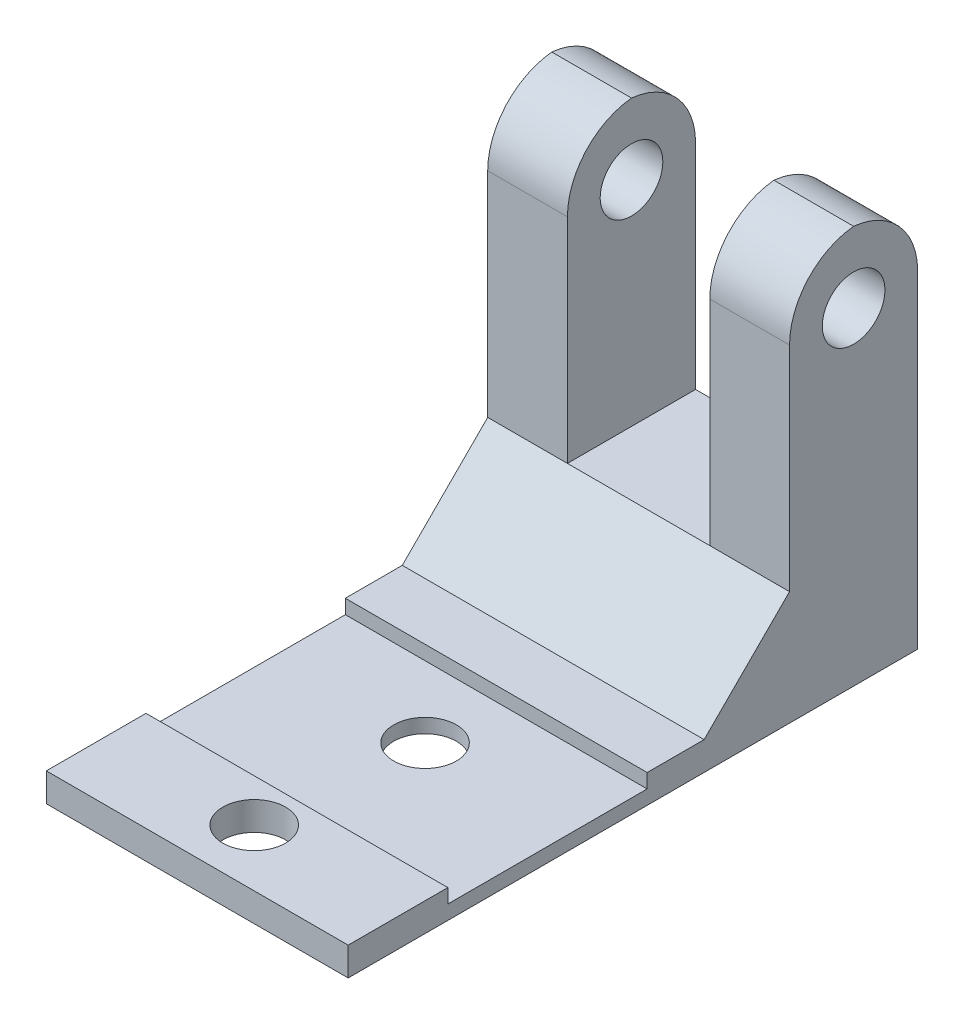
ISO-10303-21;
HEADER;
FILE_DESCRIPTION(('STEP AP214'),'2;1');
FILE_NAME('part.step','',(''),(''),'','','');
FILE_SCHEMA(('AUTOMOTIVE_DESIGN { 1 0 10303 214 1 1 1 1 }'));
ENDSEC;
DATA;
#1=APPLICATION_CONTEXT('core data for automotive mechanical design processes');
#2=APPLICATION_PROTOCOL_DEFINITION('international standard','automotive_design',2000,#1);
#3=PRODUCT_CONTEXT('',#1,'mechanical');
#4=PRODUCT('Part','Part','',(#3));
#5=PRODUCT_RELATED_PRODUCT_CATEGORY('part','',(#4));
#6=PRODUCT_DEFINITION_FORMATION('','',#4);
#7=PRODUCT_DEFINITION_CONTEXT('part definition',#1,'design');
#8=PRODUCT_DEFINITION('design','',#6,#7);
#9=PRODUCT_DEFINITION_SHAPE('','',#8);
#10=(LENGTH_UNIT() NAMED_UNIT(*) SI_UNIT(.MILLI.,.METRE.));
#11=(NAMED_UNIT(*) PLANE_ANGLE_UNIT() SI_UNIT($,.RADIAN.));
#12=(NAMED_UNIT(*) SI_UNIT($,.STERADIAN.) SOLID_ANGLE_UNIT());
#13=UNCERTAINTY_MEASURE_WITH_UNIT(LENGTH_MEASURE(1.E-05),#10,'distance_accuracy_value','');
#14=(GEOMETRIC_REPRESENTATION_CONTEXT(3) GLOBAL_UNCERTAINTY_ASSIGNED_CONTEXT((#13)) GLOBAL_UNIT_ASSIGNED_CONTEXT((#10,
#11,#12)) REPRESENTATION_CONTEXT('',''));
#15=CARTESIAN_POINT('',(0.,0.,0.));
#16=DIRECTION('',(0.,0.,1.));
#17=DIRECTION('',(1.,0.,0.));
#18=AXIS2_PLACEMENT_3D('',#15,#16,#17);
#19=CARTESIAN_POINT('',(0.,1.,0.));
#20=DIRECTION('',(0.,1.,0.));
#21=DIRECTION('',(0.,0.,1.));
#22=AXIS2_PLACEMENT_3D('',#19,#20,#21);
#23=PLANE('',#22);
#24=DIRECTION('',(-1.,0.,0.));
#25=VECTOR('',#24,1.);
#26=CARTESIAN_POINT('',(-14.28,1.,-7.29000000000001));
#27=LINE('',#26,#25);
#28=CARTESIAN_POINT('',(-3.67999999999999,1.,-7.29000000000001));
#29=VERTEX_POINT('',#28);
#30=CARTESIAN_POINT('',(-14.28,1.,-7.29000000000001));
#31=VERTEX_POINT('',#30);
#32=EDGE_CURVE('E171',#29,#31,#27,.T.);
#33=ORIENTED_EDGE('',*,*,#32,.F.);
#34=DIRECTION('',(0.,0.,-1.));
#35=VECTOR('',#34,1.);
#36=CARTESIAN_POINT('',(-3.67999999999999,1.,6.21000000000001));
#37=LINE('',#36,#35);
#38=CARTESIAN_POINT('',(-3.67999999999999,1.,-9.29000000000001));
#39=VERTEX_POINT('',#38);
#40=EDGE_CURVE('E313',#29,#39,#37,.T.);
#41=ORIENTED_EDGE('',*,*,#40,.T.);
#42=DIRECTION('',(-1.,0.,0.));
#43=VECTOR('',#42,1.);
#44=CARTESIAN_POINT('',(0.,1.,-9.29000000000001));
#45=LINE('',#44,#43);
#46=CARTESIAN_POINT('',(-14.28,1.,-9.29000000000001));
#47=VERTEX_POINT('',#46);
#48=EDGE_CURVE('E310',#39,#47,#45,.T.);
#49=ORIENTED_EDGE('',*,*,#48,.T.);
#50=DIRECTION('',(0.,0.,1.));
#51=VECTOR('',#50,1.);
#52=CARTESIAN_POINT('',(-14.28,1.,-13.79));
#53=LINE('',#52,#51);
#54=EDGE_CURVE('E242',#47,#31,#53,.T.);
#55=ORIENTED_EDGE('',*,*,#54,.T.);
#56=EDGE_LOOP('',(#33,#41,#49,#55));
#57=FACE_BOUND('',#56,.T.);
#58=ADVANCED_FACE('F33',(#57),#23,.T.);
#59=CARTESIAN_POINT('',(-6.47999999999999,1.,-13.79));
#60=DIRECTION('',(1.,0.,0.));
#61=DIRECTION('',(0.,0.,-1.));
#62=AXIS2_PLACEMENT_3D('',#59,#60,#61);
#63=PLANE('',#62);
#64=CARTESIAN_POINT('',(-6.47999999999999,11.5,-14.54));
#65=DIRECTION('',(1.,0.,0.));
#66=DIRECTION('',(0.,0.,-1.));
#67=AXIS2_PLACEMENT_3D('',#64,#65,#66);
#68=CIRCLE('',#67,1.1);
#69=CARTESIAN_POINT('',(-6.47999999999999,11.5,-15.64));
#70=VERTEX_POINT('',#69);
#71=EDGE_CURVE('E435',#70,#70,#68,.T.);
#72=ORIENTED_EDGE('',*,*,#71,.T.);
#73=EDGE_LOOP('',(#72));
#74=FACE_BOUND('',#73,.T.);
#75=DIRECTION('',(0.,1.,0.));
#76=VECTOR('',#75,1.);
#77=CARTESIAN_POINT('',(-6.47999999999999,1.,-12.29));
#78=LINE('',#77,#76);
#79=CARTESIAN_POINT('',(-6.47999999999999,4.00000000000002,-12.29));
#80=VERTEX_POINT('',#79);
#81=CARTESIAN_POINT('',(-6.47999999999999,11.5,-12.29));
#82=VERTEX_POINT('',#81);
#83=EDGE_CURVE('E209',#80,#82,#78,.T.);
#84=ORIENTED_EDGE('',*,*,#83,.T.);
#85=CARTESIAN_POINT('',(-6.47999999999999,11.5,-14.79));
#86=DIRECTION('',(1.,0.,0.));
#87=DIRECTION('',(0.,0.,-1.));
#88=AXIS2_PLACEMENT_3D('',#85,#86,#87);
#89=CIRCLE('',#88,2.5);
#90=CARTESIAN_POINT('',(-6.47999999999999,13.9874685927666,-14.54));
#91=VERTEX_POINT('',#90);
#92=EDGE_CURVE('E11',#82,#91,#89,.F.);
#93=ORIENTED_EDGE('',*,*,#92,.T.);
#94=CARTESIAN_POINT('',(-6.47999999999999,11.5,-14.29));
#95=DIRECTION('',(1.,0.,0.));
#96=DIRECTION('',(0.,0.,-1.));
#97=AXIS2_PLACEMENT_3D('',#94,#95,#96);
#98=CIRCLE('',#97,2.5);
#99=CARTESIAN_POINT('',(-6.47999999999999,11.5,-16.79));
#100=VERTEX_POINT('',#99);
#101=EDGE_CURVE('E42',#91,#100,#98,.F.);
#102=ORIENTED_EDGE('',*,*,#101,.T.);
#103=DIRECTION('',(0.,1.,0.));
#104=VECTOR('',#103,1.);
#105=CARTESIAN_POINT('',(-6.47999999999999,9.,-16.79));
#106=LINE('',#105,#104);
#107=CARTESIAN_POINT('',(-6.47999999999999,4.00000000000002,-16.79));
#108=VERTEX_POINT('',#107);
#109=EDGE_CURVE('E223',#108,#100,#106,.T.);
#110=ORIENTED_EDGE('',*,*,#109,.F.);
#111=DIRECTION('',(0.,0.,-1.));
#112=VECTOR('',#111,1.);
#113=CARTESIAN_POINT('',(-6.47999999999999,4.00000000000002,-13.79));
#114=LINE('',#113,#112);
#115=EDGE_CURVE('E193',#80,#108,#114,.T.);
#116=ORIENTED_EDGE('',*,*,#115,.F.);
#117=EDGE_LOOP('',(#84,#93,#102,#110,#116));
#118=FACE_BOUND('',#117,.T.);
#119=ADVANCED_FACE('F287',(#74,#118),#63,.F.);
#120=CARTESIAN_POINT('',(-11.48,1.,-8.79));
#121=DIRECTION('',(-1.,0.,0.));
#122=DIRECTION('',(0.,0.,1.));
#123=AXIS2_PLACEMENT_3D('',#120,#121,#122);
#124=PLANE('',#123);
#125=CARTESIAN_POINT('',(-11.48,11.5,-14.54));
#126=DIRECTION('',(-1.,0.,0.));
#127=DIRECTION('',(0.,0.,1.));
#128=AXIS2_PLACEMENT_3D('',#125,#126,#127);
#129=CIRCLE('',#128,1.1);
#130=CARTESIAN_POINT('',(-11.48,11.5,-13.44));
#131=VERTEX_POINT('',#130);
#132=EDGE_CURVE('E436',#131,#131,#129,.T.);
#133=ORIENTED_EDGE('',*,*,#132,.T.);
#134=EDGE_LOOP('',(#133));
#135=FACE_BOUND('',#134,.T.);
#136=DIRECTION('',(0.,-1.,0.));
#137=VECTOR('',#136,1.);
#138=CARTESIAN_POINT('',(-11.48,9.,-16.79));
#139=LINE('',#138,#137);
#140=CARTESIAN_POINT('',(-11.48,11.5,-16.79));
#141=VERTEX_POINT('',#140);
#142=CARTESIAN_POINT('',(-11.48,4.00000000000002,-16.79));
#143=VERTEX_POINT('',#142);
#144=EDGE_CURVE('E214',#141,#143,#139,.T.);
#145=ORIENTED_EDGE('',*,*,#144,.F.);
#146=CARTESIAN_POINT('',(-11.48,11.5,-14.29));
#147=DIRECTION('',(-1.,0.,0.));
#148=DIRECTION('',(0.,0.,1.));
#149=AXIS2_PLACEMENT_3D('',#146,#147,#148);
#150=CIRCLE('',#149,2.5);
#151=CARTESIAN_POINT('',(-11.48,13.9874685927666,-14.54));
#152=VERTEX_POINT('',#151);
#153=EDGE_CURVE('E262',#141,#152,#150,.F.);
#154=ORIENTED_EDGE('',*,*,#153,.T.);
#155=CARTESIAN_POINT('',(-11.48,11.5,-14.79));
#156=DIRECTION('',(-1.,0.,0.));
#157=DIRECTION('',(0.,0.,1.));
#158=AXIS2_PLACEMENT_3D('',#155,#156,#157);
#159=CIRCLE('',#158,2.5);
#160=CARTESIAN_POINT('',(-11.48,11.5,-12.29));
#161=VERTEX_POINT('',#160);
#162=EDGE_CURVE('E260',#152,#161,#159,.F.);
#163=ORIENTED_EDGE('',*,*,#162,.T.);
#164=DIRECTION('',(0.,-1.,0.));
#165=VECTOR('',#164,1.);
#166=CARTESIAN_POINT('',(-11.48,1.,-12.29));
#167=LINE('',#166,#165);
#168=CARTESIAN_POINT('',(-11.48,4.00000000000002,-12.29));
#169=VERTEX_POINT('',#168);
#170=EDGE_CURVE('E207',#161,#169,#167,.T.);
#171=ORIENTED_EDGE('',*,*,#170,.T.);
#172=DIRECTION('',(0.,0.,1.));
#173=VECTOR('',#172,1.);
#174=CARTESIAN_POINT('',(-11.48,4.00000000000002,-12.29));
#175=LINE('',#174,#173);
#176=EDGE_CURVE('E183',#143,#169,#175,.T.);
#177=ORIENTED_EDGE('',*,*,#176,.F.);
#178=EDGE_LOOP('',(#145,#154,#163,#171,#177));
#179=FACE_BOUND('',#178,.T.);
#180=ADVANCED_FACE('F354',(#135,#179),#124,.F.);
#181=DIRECTION('',(1.,0.,0.));
#182=VECTOR('',#181,1.);
#183=CARTESIAN_POINT('',(-14.28,1.,-0.289999999999993));
#184=LINE('',#183,#182);
#185=CARTESIAN_POINT('',(-14.28,1.,-0.289999999999993));
#186=VERTEX_POINT('',#185);
#187=CARTESIAN_POINT('',(-3.67999999999999,1.,-0.289999999999993));
#188=VERTEX_POINT('',#187);
#189=EDGE_CURVE('E389',#186,#188,#184,.T.);
#190=ORIENTED_EDGE('',*,*,#189,.F.);
#191=CARTESIAN_POINT('',(-14.28,1.,3.21000000000001));
#192=VERTEX_POINT('',#191);
#193=EDGE_CURVE('E176',#186,#192,#53,.T.);
#194=ORIENTED_EDGE('',*,*,#193,.T.);
#195=DIRECTION('',(-1.,0.,0.));
#196=VECTOR('',#195,1.);
#197=CARTESIAN_POINT('',(-3.67999999999999,1.,3.21000000000001));
#198=LINE('',#197,#196);
#199=CARTESIAN_POINT('',(-3.67999999999999,1.,3.21000000000001));
#200=VERTEX_POINT('',#199);
#201=EDGE_CURVE('E196',#200,#192,#198,.T.);
#202=ORIENTED_EDGE('',*,*,#201,.F.);
#203=EDGE_CURVE('E238',#200,#188,#37,.T.);
#204=ORIENTED_EDGE('',*,*,#203,.T.);
#205=EDGE_LOOP('',(#190,#194,#202,#204));
#206=FACE_BOUND('',#205,.T.);
#207=CARTESIAN_POINT('',(-8.98,1.,1.21000000000001));
#208=DIRECTION('',(0.,1.,0.));
#209=DIRECTION('',(0.,0.,1.));
#210=AXIS2_PLACEMENT_3D('',#207,#208,#209);
#211=CIRCLE('',#210,1.1);
#212=CARTESIAN_POINT('',(-8.98,1.,2.31000000000001));
#213=VERTEX_POINT('',#212);
#214=EDGE_CURVE('E227',#213,#213,#211,.T.);
#215=ORIENTED_EDGE('',*,*,#214,.F.);
#216=EDGE_LOOP('',(#215));
#217=FACE_BOUND('',#216,.T.);
#218=ADVANCED_FACE('F370',(#206,#217),#23,.T.);
#219=CARTESIAN_POINT('',(0.,0.,0.));
#220=DIRECTION('',(0.,1.,0.));
#221=DIRECTION('',(0.,0.,1.));
#222=AXIS2_PLACEMENT_3D('',#219,#220,#221);
#223=PLANE('',#222);
#224=DIRECTION('',(-1.,0.,0.));
#225=VECTOR('',#224,1.);
#226=CARTESIAN_POINT('',(-3.67999999999999,0.,-16.79));
#227=LINE('',#226,#225);
#228=CARTESIAN_POINT('',(-3.67999999999999,0.,-16.79));
#229=VERTEX_POINT('',#228);
#230=CARTESIAN_POINT('',(-14.28,0.,-16.79));
#231=VERTEX_POINT('',#230);
#232=EDGE_CURVE('E221',#229,#231,#227,.T.);
#233=ORIENTED_EDGE('',*,*,#232,.F.);
#234=DIRECTION('',(0.,0.,-1.));
#235=VECTOR('',#234,1.);
#236=CARTESIAN_POINT('',(-3.67999999999999,0.,6.21000000000001));
#237=LINE('',#236,#235);
#238=CARTESIAN_POINT('',(-3.67999999999999,0.,3.21000000000001));
#239=VERTEX_POINT('',#238);
#240=EDGE_CURVE('E248',#239,#229,#237,.T.);
#241=ORIENTED_EDGE('',*,*,#240,.F.);
#242=DIRECTION('',(-1.,0.,0.));
#243=VECTOR('',#242,1.);
#244=CARTESIAN_POINT('',(0.,0.,3.21000000000001));
#245=LINE('',#244,#243);
#246=CARTESIAN_POINT('',(-14.28,0.,3.21000000000001));
#247=VERTEX_POINT('',#246);
#248=EDGE_CURVE('E201',#239,#247,#245,.T.);
#249=ORIENTED_EDGE('',*,*,#248,.T.);
#250=DIRECTION('',(0.,0.,1.));
#251=VECTOR('',#250,1.);
#252=CARTESIAN_POINT('',(-14.28,0.,-13.79));
#253=LINE('',#252,#251);
#254=EDGE_CURVE('E235',#231,#247,#253,.T.);
#255=ORIENTED_EDGE('',*,*,#254,.F.);
#256=EDGE_LOOP('',(#233,#241,#249,#255));
#257=FACE_BOUND('',#256,.T.);
#258=CARTESIAN_POINT('',(-8.98,0.,1.21000000000001));
#259=DIRECTION('',(0.,1.,0.));
#260=DIRECTION('',(0.,0.,1.));
#261=AXIS2_PLACEMENT_3D('',#258,#259,#260);
#262=CIRCLE('',#261,1.1);
#263=CARTESIAN_POINT('',(-8.98,0.,2.31000000000001));
#264=VERTEX_POINT('',#263);
#265=EDGE_CURVE('E226',#264,#264,#262,.T.);
#266=ORIENTED_EDGE('',*,*,#265,.T.);
#267=EDGE_LOOP('',(#266));
#268=FACE_BOUND('',#267,.T.);
#269=CARTESIAN_POINT('',(-8.97999999999999,0.,-4.78999999999999));
#270=DIRECTION('',(0.,1.,0.));
#271=DIRECTION('',(0.,0.,1.));
#272=AXIS2_PLACEMENT_3D('',#269,#270,#271);
#273=CIRCLE('',#272,1.1);
#274=CARTESIAN_POINT('',(-8.97999999999999,0.,-3.68999999999999));
#275=VERTEX_POINT('',#274);
#276=EDGE_CURVE('E230',#275,#275,#273,.T.);
#277=ORIENTED_EDGE('',*,*,#276,.T.);
#278=EDGE_LOOP('',(#277));
#279=FACE_BOUND('',#278,.T.);
#280=ADVANCED_FACE('F321',(#257,#268,#279),#223,.F.);
#281=CARTESIAN_POINT('',(-14.28,1.,-13.79));
#282=DIRECTION('',(1.,0.,0.));
#283=DIRECTION('',(0.,0.,-1.));
#284=AXIS2_PLACEMENT_3D('',#281,#282,#283);
#285=PLANE('',#284);
#286=CARTESIAN_POINT('',(-14.28,11.5,-14.54));
#287=DIRECTION('',(1.,0.,0.));
#288=DIRECTION('',(0.,0.,-1.));
#289=AXIS2_PLACEMENT_3D('',#286,#287,#288);
#290=CIRCLE('',#289,1.1);
#291=CARTESIAN_POINT('',(-14.28,11.5,-15.64));
#292=VERTEX_POINT('',#291);
#293=EDGE_CURVE('E279',#292,#292,#290,.T.);
#294=ORIENTED_EDGE('',*,*,#293,.T.);
#295=EDGE_LOOP('',(#294));
#296=FACE_BOUND('',#295,.T.);
#297=CARTESIAN_POINT('',(-14.28,11.5,-14.79));
#298=DIRECTION('',(1.,0.,0.));
#299=DIRECTION('',(0.,0.,-1.));
#300=AXIS2_PLACEMENT_3D('',#297,#298,#299);
#301=CIRCLE('',#300,2.5);
#302=CARTESIAN_POINT('',(-14.28,11.5,-12.29));
#303=VERTEX_POINT('',#302);
#304=CARTESIAN_POINT('',(-14.28,13.9874685927666,-14.54));
#305=VERTEX_POINT('',#304);
#306=EDGE_CURVE('E250',#303,#305,#301,.F.);
#307=ORIENTED_EDGE('',*,*,#306,.T.);
#308=CARTESIAN_POINT('',(-14.28,11.5,-14.29));
#309=DIRECTION('',(1.,0.,0.));
#310=DIRECTION('',(0.,0.,-1.));
#311=AXIS2_PLACEMENT_3D('',#308,#309,#310);
#312=CIRCLE('',#311,2.5);
#313=CARTESIAN_POINT('',(-14.28,11.5,-16.79));
#314=VERTEX_POINT('',#313);
#315=EDGE_CURVE('E252',#305,#314,#312,.F.);
#316=ORIENTED_EDGE('',*,*,#315,.T.);
#317=DIRECTION('',(0.,1.,0.));
#318=VECTOR('',#317,1.);
#319=CARTESIAN_POINT('',(-14.28,9.,-16.79));
#320=LINE('',#319,#318);
#321=EDGE_CURVE('E216',#231,#314,#320,.T.);
#322=ORIENTED_EDGE('',*,*,#321,.F.);
#323=ORIENTED_EDGE('',*,*,#254,.T.);
#324=DIRECTION('',(0.,1.,0.));
#325=VECTOR('',#324,1.);
#326=CARTESIAN_POINT('',(-14.28,-9.,3.21000000000001));
#327=LINE('',#326,#325);
#328=EDGE_CURVE('E199',#247,#192,#327,.T.);
#329=ORIENTED_EDGE('',*,*,#328,.T.);
#330=ORIENTED_EDGE('',*,*,#193,.F.);
#331=DIRECTION('',(0.,1.,0.));
#332=VECTOR('',#331,1.);
#333=CARTESIAN_POINT('',(-14.28,0.5,-0.289999999999993));
#334=LINE('',#333,#332);
#335=CARTESIAN_POINT('',(-14.28,0.5,-0.289999999999993));
#336=VERTEX_POINT('',#335);
#337=EDGE_CURVE('E155',#336,#186,#334,.T.);
#338=ORIENTED_EDGE('',*,*,#337,.F.);
#339=DIRECTION('',(0.,0.,1.));
#340=VECTOR('',#339,1.);
#341=CARTESIAN_POINT('',(-14.28,0.5,-0.289999999999993));
#342=LINE('',#341,#340);
#343=CARTESIAN_POINT('',(-14.28,0.5,-7.29000000000001));
#344=VERTEX_POINT('',#343);
#345=EDGE_CURVE('E162',#344,#336,#342,.T.);
#346=ORIENTED_EDGE('',*,*,#345,.F.);
#347=DIRECTION('',(0.,1.,0.));
#348=VECTOR('',#347,1.);
#349=CARTESIAN_POINT('',(-14.28,0.5,-7.29000000000001));
#350=LINE('',#349,#348);
#351=EDGE_CURVE('E345',#344,#31,#350,.T.);
#352=ORIENTED_EDGE('',*,*,#351,.T.);
#353=ORIENTED_EDGE('',*,*,#54,.F.);
#354=DIRECTION('',(0.,0.707106781186552,-0.707106781186543));
#355=VECTOR('',#354,1.);
#356=CARTESIAN_POINT('',(-14.28,3.24999999999999,-11.54));
#357=LINE('',#356,#355);
#358=CARTESIAN_POINT('',(-14.28,4.00000000000002,-12.29));
#359=VERTEX_POINT('',#358);
#360=EDGE_CURVE('E331',#47,#359,#357,.T.);
#361=ORIENTED_EDGE('',*,*,#360,.T.);
#362=DIRECTION('',(0.,1.,0.));
#363=VECTOR('',#362,1.);
#364=CARTESIAN_POINT('',(-14.28,1.,-12.29));
#365=LINE('',#364,#363);
#366=EDGE_CURVE('E211',#359,#303,#365,.T.);
#367=ORIENTED_EDGE('',*,*,#366,.T.);
#368=EDGE_LOOP('',(#307,#316,#322,#323,#329,#330,#338,#346,#352,#353,#361,#367));
#369=FACE_BOUND('',#368,.T.);
#370=ADVANCED_FACE('F174',(#296,#369),#285,.F.);
#371=CARTESIAN_POINT('',(-3.67999999999999,1.,6.21000000000001));
#372=DIRECTION('',(-1.,0.,0.));
#373=DIRECTION('',(0.,0.,1.));
#374=AXIS2_PLACEMENT_3D('',#371,#372,#373);
#375=PLANE('',#374);
#376=CARTESIAN_POINT('',(-3.67999999999999,11.5,-14.54));
#377=DIRECTION('',(1.,0.,0.));
#378=DIRECTION('',(0.,0.,-1.));
#379=AXIS2_PLACEMENT_3D('',#376,#377,#378);
#380=CIRCLE('',#379,1.1);
#381=CARTESIAN_POINT('',(-3.67999999999999,11.5,-15.64));
#382=VERTEX_POINT('',#381);
#383=EDGE_CURVE('E274',#382,#382,#380,.T.);
#384=ORIENTED_EDGE('',*,*,#383,.F.);
#385=EDGE_LOOP('',(#384));
#386=FACE_BOUND('',#385,.T.);
#387=CARTESIAN_POINT('',(-3.67999999999999,11.5,-14.29));
#388=DIRECTION('',(-1.,0.,0.));
#389=DIRECTION('',(0.,0.,1.));
#390=AXIS2_PLACEMENT_3D('',#387,#388,#389);
#391=CIRCLE('',#390,2.5);
#392=CARTESIAN_POINT('',(-3.67999999999999,11.5,-16.79));
#393=VERTEX_POINT('',#392);
#394=CARTESIAN_POINT('',(-3.67999999999999,13.9874685927666,-14.54));
#395=VERTEX_POINT('',#394);
#396=EDGE_CURVE('E266',#393,#395,#391,.F.);
#397=ORIENTED_EDGE('',*,*,#396,.T.);
#398=CARTESIAN_POINT('',(-3.67999999999999,11.5,-14.79));
#399=DIRECTION('',(-1.,0.,0.));
#400=DIRECTION('',(0.,0.,1.));
#401=AXIS2_PLACEMENT_3D('',#398,#399,#400);
#402=CIRCLE('',#401,2.5);
#403=CARTESIAN_POINT('',(-3.67999999999999,11.5,-12.29));
#404=VERTEX_POINT('',#403);
#405=EDGE_CURVE('E268',#395,#404,#402,.F.);
#406=ORIENTED_EDGE('',*,*,#405,.T.);
#407=DIRECTION('',(0.,1.,0.));
#408=VECTOR('',#407,1.);
#409=CARTESIAN_POINT('',(-3.67999999999999,1.,-12.29));
#410=LINE('',#409,#408);
#411=CARTESIAN_POINT('',(-3.67999999999999,4.00000000000002,-12.29));
#412=VERTEX_POINT('',#411);
#413=EDGE_CURVE('E204',#412,#404,#410,.T.);
#414=ORIENTED_EDGE('',*,*,#413,.F.);
#415=DIRECTION('',(0.,-0.707106781186552,0.707106781186543));
#416=VECTOR('',#415,1.);
#417=CARTESIAN_POINT('',(-3.67999999999999,-6.75000000000001,-1.54000000000009));
#418=LINE('',#417,#416);
#419=EDGE_CURVE('E309',#412,#39,#418,.T.);
#420=ORIENTED_EDGE('',*,*,#419,.T.);
#421=ORIENTED_EDGE('',*,*,#40,.F.);
#422=DIRECTION('',(0.,1.,0.));
#423=VECTOR('',#422,1.);
#424=CARTESIAN_POINT('',(-3.67999999999999,0.5,-7.29000000000001));
#425=LINE('',#424,#423);
#426=CARTESIAN_POINT('',(-3.67999999999999,0.5,-7.29000000000001));
#427=VERTEX_POINT('',#426);
#428=EDGE_CURVE('E178',#427,#29,#425,.T.);
#429=ORIENTED_EDGE('',*,*,#428,.F.);
#430=DIRECTION('',(0.,0.,-1.));
#431=VECTOR('',#430,1.);
#432=CARTESIAN_POINT('',(-3.67999999999999,0.5,-0.289999999999993));
#433=LINE('',#432,#431);
#434=CARTESIAN_POINT('',(-3.67999999999999,0.5,-0.289999999999993));
#435=VERTEX_POINT('',#434);
#436=EDGE_CURVE('E161',#435,#427,#433,.T.);
#437=ORIENTED_EDGE('',*,*,#436,.F.);
#438=DIRECTION('',(0.,1.,0.));
#439=VECTOR('',#438,1.);
#440=CARTESIAN_POINT('',(-3.67999999999999,0.5,-0.289999999999993));
#441=LINE('',#440,#439);
#442=EDGE_CURVE('E158',#435,#188,#441,.T.);
#443=ORIENTED_EDGE('',*,*,#442,.T.);
#444=ORIENTED_EDGE('',*,*,#203,.F.);
#445=DIRECTION('',(0.,-1.,0.));
#446=VECTOR('',#445,1.);
#447=CARTESIAN_POINT('',(-3.67999999999999,1.,3.21000000000001));
#448=LINE('',#447,#446);
#449=EDGE_CURVE('E253',#200,#239,#448,.T.);
#450=ORIENTED_EDGE('',*,*,#449,.T.);
#451=ORIENTED_EDGE('',*,*,#240,.T.);
#452=DIRECTION('',(0.,-1.,0.));
#453=VECTOR('',#452,1.);
#454=CARTESIAN_POINT('',(-3.67999999999999,9.,-16.79));
#455=LINE('',#454,#453);
#456=EDGE_CURVE('E219',#393,#229,#455,.T.);
#457=ORIENTED_EDGE('',*,*,#456,.F.);
#458=EDGE_LOOP('',(#397,#406,#414,#420,#421,#429,#437,#443,#444,#450,#451,#457));
#459=FACE_BOUND('',#458,.T.);
#460=ADVANCED_FACE('F330',(#386,#459),#375,.F.);
#461=CARTESIAN_POINT('',(-8.97999999999999,1.,-4.78999999999999));
#462=DIRECTION('',(0.,-1.,0.));
#463=DIRECTION('',(0.,0.,-1.));
#464=AXIS2_PLACEMENT_3D('',#461,#462,#463);
#465=CYLINDRICAL_SURFACE('',#464,1.1);
#466=CARTESIAN_POINT('',(-8.97999999999999,0.5,-4.78999999999999));
#467=DIRECTION('',(0.,-1.,0.));
#468=DIRECTION('',(0.,0.,-1.));
#469=AXIS2_PLACEMENT_3D('',#466,#467,#468);
#470=CIRCLE('',#469,1.1);
#471=CARTESIAN_POINT('',(-8.97999999999999,0.5,-5.89));
#472=VERTEX_POINT('',#471);
#473=EDGE_CURVE('E187',#472,#472,#470,.T.);
#474=ORIENTED_EDGE('',*,*,#473,.F.);
#475=EDGE_LOOP('',(#474));
#476=FACE_BOUND('',#475,.T.);
#477=ORIENTED_EDGE('',*,*,#276,.F.);
#478=EDGE_LOOP('',(#477));
#479=FACE_BOUND('',#478,.T.);
#480=ADVANCED_FACE('F395',(#476,#479),#465,.F.);
#481=CARTESIAN_POINT('',(-8.98,1.,1.21000000000001));
#482=DIRECTION('',(0.,-1.,0.));
#483=DIRECTION('',(0.,0.,-1.));
#484=AXIS2_PLACEMENT_3D('',#481,#482,#483);
#485=CYLINDRICAL_SURFACE('',#484,1.1);
#486=ORIENTED_EDGE('',*,*,#214,.T.);
#487=EDGE_LOOP('',(#486));
#488=FACE_BOUND('',#487,.T.);
#489=ORIENTED_EDGE('',*,*,#265,.F.);
#490=EDGE_LOOP('',(#489));
#491=FACE_BOUND('',#490,.T.);
#492=ADVANCED_FACE('F392',(#488,#491),#485,.F.);
#493=CARTESIAN_POINT('',(0.,0.,-16.79));
#494=DIRECTION('',(0.,0.,-1.));
#495=DIRECTION('',(-1.,0.,0.));
#496=AXIS2_PLACEMENT_3D('',#493,#494,#495);
#497=PLANE('',#496);
#498=ORIENTED_EDGE('',*,*,#321,.T.);
#499=DIRECTION('',(-1.,0.,0.));
#500=VECTOR('',#499,1.);
#501=CARTESIAN_POINT('',(0.,11.5,-16.79));
#502=LINE('',#501,#500);
#503=EDGE_CURVE('E257',#314,#141,#502,.F.);
#504=ORIENTED_EDGE('',*,*,#503,.T.);
#505=ORIENTED_EDGE('',*,*,#144,.T.);
#506=DIRECTION('',(-1.,0.,0.));
#507=VECTOR('',#506,1.);
#508=CARTESIAN_POINT('',(5.26427190999917,4.00000000000002,-16.79));
#509=LINE('',#508,#507);
#510=EDGE_CURVE('E190',#108,#143,#509,.T.);
#511=ORIENTED_EDGE('',*,*,#510,.F.);
#512=ORIENTED_EDGE('',*,*,#109,.T.);
#513=DIRECTION('',(-1.,0.,0.));
#514=VECTOR('',#513,1.);
#515=CARTESIAN_POINT('',(-3.67999999999999,11.5,-16.79));
#516=LINE('',#515,#514);
#517=EDGE_CURVE('E255',#100,#393,#516,.F.);
#518=ORIENTED_EDGE('',*,*,#517,.T.);
#519=ORIENTED_EDGE('',*,*,#456,.T.);
#520=ORIENTED_EDGE('',*,*,#232,.T.);
#521=EDGE_LOOP('',(#498,#504,#505,#511,#512,#518,#519,#520));
#522=FACE_BOUND('',#521,.T.);
#523=ADVANCED_FACE('F290',(#522),#497,.T.);
#524=CARTESIAN_POINT('',(-103.68,1.,-12.29));
#525=DIRECTION('',(0.,0.,-1.));
#526=DIRECTION('',(-1.,0.,0.));
#527=AXIS2_PLACEMENT_3D('',#524,#525,#526);
#528=PLANE('',#527);
#529=ORIENTED_EDGE('',*,*,#413,.T.);
#530=DIRECTION('',(1.,0.,0.));
#531=VECTOR('',#530,1.);
#532=CARTESIAN_POINT('',(-103.68,11.5,-12.29));
#533=LINE('',#532,#531);
#534=EDGE_CURVE('E270',#404,#82,#533,.F.);
#535=ORIENTED_EDGE('',*,*,#534,.T.);
#536=ORIENTED_EDGE('',*,*,#83,.F.);
#537=DIRECTION('',(1.,0.,0.));
#538=VECTOR('',#537,1.);
#539=CARTESIAN_POINT('',(-103.68,4.00000000000002,-12.29));
#540=LINE('',#539,#538);
#541=EDGE_CURVE('E302',#80,#412,#540,.T.);
#542=ORIENTED_EDGE('',*,*,#541,.T.);
#543=EDGE_LOOP('',(#529,#535,#536,#542));
#544=FACE_BOUND('',#543,.T.);
#545=ADVANCED_FACE('F301',(#544),#528,.F.);
#546=ORIENTED_EDGE('',*,*,#170,.F.);
#547=DIRECTION('',(1.,0.,0.));
#548=VECTOR('',#547,1.);
#549=CARTESIAN_POINT('',(-14.28,11.5,-12.29));
#550=LINE('',#549,#548);
#551=EDGE_CURVE('E264',#161,#303,#550,.F.);
#552=ORIENTED_EDGE('',*,*,#551,.T.);
#553=ORIENTED_EDGE('',*,*,#366,.F.);
#554=DIRECTION('',(1.,0.,0.));
#555=VECTOR('',#554,1.);
#556=CARTESIAN_POINT('',(-103.68,4.00000000000002,-12.29));
#557=LINE('',#556,#555);
#558=EDGE_CURVE('E311',#359,#169,#557,.T.);
#559=ORIENTED_EDGE('',*,*,#558,.T.);
#560=EDGE_LOOP('',(#546,#552,#553,#559));
#561=FACE_BOUND('',#560,.T.);
#562=ADVANCED_FACE('F339',(#561),#528,.F.);
#563=CARTESIAN_POINT('',(-103.68,4.00000000000002,-12.29));
#564=DIRECTION('',(0.,-0.707106781186543,-0.707106781186552));
#565=DIRECTION('',(1.,0.,0.));
#566=AXIS2_PLACEMENT_3D('',#563,#564,#565);
#567=PLANE('',#566);
#568=ORIENTED_EDGE('',*,*,#541,.F.);
#569=DIRECTION('',(-1.,0.,0.));
#570=VECTOR('',#569,1.);
#571=CARTESIAN_POINT('',(5.26427190999917,4.00000000000002,-12.29));
#572=LINE('',#571,#570);
#573=EDGE_CURVE('E186',#80,#169,#572,.T.);
#574=ORIENTED_EDGE('',*,*,#573,.T.);
#575=ORIENTED_EDGE('',*,*,#558,.F.);
#576=ORIENTED_EDGE('',*,*,#360,.F.);
#577=ORIENTED_EDGE('',*,*,#48,.F.);
#578=ORIENTED_EDGE('',*,*,#419,.F.);
#579=EDGE_LOOP('',(#568,#574,#575,#576,#577,#578));
#580=FACE_BOUND('',#579,.T.);
#581=ADVANCED_FACE('F305',(#580),#567,.F.);
#582=CARTESIAN_POINT('',(-3.67999999999999,-9.,3.21000000000001));
#583=DIRECTION('',(0.,0.,-1.));
#584=DIRECTION('',(-1.,0.,0.));
#585=AXIS2_PLACEMENT_3D('',#582,#583,#584);
#586=PLANE('',#585);
#587=ORIENTED_EDGE('',*,*,#449,.F.);
#588=ORIENTED_EDGE('',*,*,#201,.T.);
#589=ORIENTED_EDGE('',*,*,#328,.F.);
#590=ORIENTED_EDGE('',*,*,#248,.F.);
#591=EDGE_LOOP('',(#587,#588,#589,#590));
#592=FACE_BOUND('',#591,.T.);
#593=ADVANCED_FACE('F326',(#592),#586,.F.);
#594=CARTESIAN_POINT('',(5.26427190999917,4.00000000000002,-12.29));
#595=DIRECTION('',(0.,-1.,0.));
#596=DIRECTION('',(0.,0.,-1.));
#597=AXIS2_PLACEMENT_3D('',#594,#595,#596);
#598=PLANE('',#597);
#599=ORIENTED_EDGE('',*,*,#573,.F.);
#600=ORIENTED_EDGE('',*,*,#115,.T.);
#601=ORIENTED_EDGE('',*,*,#510,.T.);
#602=ORIENTED_EDGE('',*,*,#176,.T.);
#603=EDGE_LOOP('',(#599,#600,#601,#602));
#604=FACE_BOUND('',#603,.T.);
#605=ADVANCED_FACE('F296',(#604),#598,.F.);
#606=CARTESIAN_POINT('',(-14.28,0.5,-7.29000000000001));
#607=DIRECTION('',(0.,0.,-1.));
#608=DIRECTION('',(-1.,0.,0.));
#609=AXIS2_PLACEMENT_3D('',#606,#607,#608);
#610=PLANE('',#609);
#611=ORIENTED_EDGE('',*,*,#32,.T.);
#612=ORIENTED_EDGE('',*,*,#351,.F.);
#613=DIRECTION('',(-1.,0.,0.));
#614=VECTOR('',#613,1.);
#615=CARTESIAN_POINT('',(-14.28,0.5,-7.29000000000001));
#616=LINE('',#615,#614);
#617=EDGE_CURVE('E168',#427,#344,#616,.T.);
#618=ORIENTED_EDGE('',*,*,#617,.F.);
#619=ORIENTED_EDGE('',*,*,#428,.T.);
#620=EDGE_LOOP('',(#611,#612,#618,#619));
#621=FACE_BOUND('',#620,.T.);
#622=ADVANCED_FACE('F418',(#621),#610,.F.);
#623=CARTESIAN_POINT('',(-14.28,0.5,-0.289999999999993));
#624=DIRECTION('',(0.,0.,1.));
#625=DIRECTION('',(1.,0.,0.));
#626=AXIS2_PLACEMENT_3D('',#623,#624,#625);
#627=PLANE('',#626);
#628=ORIENTED_EDGE('',*,*,#189,.T.);
#629=ORIENTED_EDGE('',*,*,#442,.F.);
#630=DIRECTION('',(1.,0.,0.));
#631=VECTOR('',#630,1.);
#632=CARTESIAN_POINT('',(-14.28,0.5,-0.289999999999993));
#633=LINE('',#632,#631);
#634=EDGE_CURVE('E151',#336,#435,#633,.T.);
#635=ORIENTED_EDGE('',*,*,#634,.F.);
#636=ORIENTED_EDGE('',*,*,#337,.T.);
#637=EDGE_LOOP('',(#628,#629,#635,#636));
#638=FACE_BOUND('',#637,.T.);
#639=ADVANCED_FACE('F153',(#638),#627,.F.);
#640=CARTESIAN_POINT('',(0.,0.5,0.));
#641=DIRECTION('',(0.,-1.,0.));
#642=DIRECTION('',(0.,0.,-1.));
#643=AXIS2_PLACEMENT_3D('',#640,#641,#642);
#644=PLANE('',#643);
#645=ORIENTED_EDGE('',*,*,#473,.T.);
#646=EDGE_LOOP('',(#645));
#647=FACE_BOUND('',#646,.T.);
#648=ORIENTED_EDGE('',*,*,#345,.T.);
#649=ORIENTED_EDGE('',*,*,#634,.T.);
#650=ORIENTED_EDGE('',*,*,#436,.T.);
#651=ORIENTED_EDGE('',*,*,#617,.T.);
#652=EDGE_LOOP('',(#648,#649,#650,#651));
#653=FACE_BOUND('',#652,.T.);
#654=ADVANCED_FACE('F166',(#647,#653),#644,.F.);
#655=CARTESIAN_POINT('',(-23.68,11.5,-14.54));
#656=DIRECTION('',(1.,0.,0.));
#657=DIRECTION('',(0.,0.,-1.));
#658=AXIS2_PLACEMENT_3D('',#655,#656,#657);
#659=CYLINDRICAL_SURFACE('',#658,1.1);
#660=ORIENTED_EDGE('',*,*,#383,.T.);
#661=EDGE_LOOP('',(#660));
#662=FACE_BOUND('',#661,.T.);
#663=ORIENTED_EDGE('',*,*,#71,.F.);
#664=EDGE_LOOP('',(#663));
#665=FACE_BOUND('',#664,.T.);
#666=ADVANCED_FACE('F365',(#662,#665),#659,.F.);
#667=ORIENTED_EDGE('',*,*,#293,.F.);
#668=EDGE_LOOP('',(#667));
#669=FACE_BOUND('',#668,.T.);
#670=ORIENTED_EDGE('',*,*,#132,.F.);
#671=EDGE_LOOP('',(#670));
#672=FACE_BOUND('',#671,.T.);
#673=ADVANCED_FACE('F358',(#669,#672),#659,.F.);
#674=CARTESIAN_POINT('',(0.,11.5,-14.79));
#675=DIRECTION('',(-1.,0.,0.));
#676=DIRECTION('',(0.,0.,1.));
#677=AXIS2_PLACEMENT_3D('',#674,#675,#676);
#678=CYLINDRICAL_SURFACE('',#677,2.5);
#679=ORIENTED_EDGE('',*,*,#551,.F.);
#680=ORIENTED_EDGE('',*,*,#162,.F.);
#681=DIRECTION('',(-1.,0.,0.));
#682=VECTOR('',#681,1.);
#683=CARTESIAN_POINT('',(-12.88,13.9874685927666,-14.54));
#684=LINE('',#683,#682);
#685=EDGE_CURVE('E272',#305,#152,#684,.F.);
#686=ORIENTED_EDGE('',*,*,#685,.F.);
#687=ORIENTED_EDGE('',*,*,#306,.F.);
#688=EDGE_LOOP('',(#679,#680,#686,#687));
#689=FACE_BOUND('',#688,.T.);
#690=ADVANCED_FACE('F356',(#689),#678,.T.);
#691=CARTESIAN_POINT('',(0.,11.5,-14.29));
#692=DIRECTION('',(-1.,0.,0.));
#693=DIRECTION('',(0.,0.,1.));
#694=AXIS2_PLACEMENT_3D('',#691,#692,#693);
#695=CYLINDRICAL_SURFACE('',#694,2.5);
#696=ORIENTED_EDGE('',*,*,#153,.F.);
#697=ORIENTED_EDGE('',*,*,#503,.F.);
#698=ORIENTED_EDGE('',*,*,#315,.F.);
#699=ORIENTED_EDGE('',*,*,#685,.T.);
#700=EDGE_LOOP('',(#696,#697,#698,#699));
#701=FACE_BOUND('',#700,.T.);
#702=ADVANCED_FACE('F351',(#701),#695,.T.);
#703=CARTESIAN_POINT('',(0.,11.5,-14.29));
#704=DIRECTION('',(1.,0.,0.));
#705=DIRECTION('',(0.,0.,-1.));
#706=AXIS2_PLACEMENT_3D('',#703,#704,#705);
#707=CYLINDRICAL_SURFACE('',#706,2.5);
#708=ORIENTED_EDGE('',*,*,#517,.F.);
#709=ORIENTED_EDGE('',*,*,#101,.F.);
#710=DIRECTION('',(1.,0.,0.));
#711=VECTOR('',#710,1.);
#712=CARTESIAN_POINT('',(-5.07999999999999,13.9874685927666,-14.54));
#713=LINE('',#712,#711);
#714=EDGE_CURVE('E37',#395,#91,#713,.F.);
#715=ORIENTED_EDGE('',*,*,#714,.F.);
#716=ORIENTED_EDGE('',*,*,#396,.F.);
#717=EDGE_LOOP('',(#708,#709,#715,#716));
#718=FACE_BOUND('',#717,.T.);
#719=ADVANCED_FACE('F35',(#718),#707,.T.);
#720=CARTESIAN_POINT('',(0.,11.5,-14.79));
#721=DIRECTION('',(1.,0.,0.));
#722=DIRECTION('',(0.,0.,-1.));
#723=AXIS2_PLACEMENT_3D('',#720,#721,#722);
#724=CYLINDRICAL_SURFACE('',#723,2.5);
#725=ORIENTED_EDGE('',*,*,#92,.F.);
#726=ORIENTED_EDGE('',*,*,#534,.F.);
#727=ORIENTED_EDGE('',*,*,#405,.F.);
#728=ORIENTED_EDGE('',*,*,#714,.T.);
#729=EDGE_LOOP('',(#725,#726,#727,#728));
#730=FACE_BOUND('',#729,.T.);
#731=ADVANCED_FACE('F283',(#730),#724,.T.);
#732=CLOSED_SHELL('',(#58,#119,#180,#218,#280,#370,#460,#480,#492,#523,#545,#562,#581,#593,#605,
#622,#639,#654,#666,#673,#690,#702,#719,#731));
#733=MANIFOLD_SOLID_BREP('B2',#732);
#734=ADVANCED_BREP_SHAPE_REPRESENTATION('',(#18,#733),#14);
#735=SHAPE_DEFINITION_REPRESENTATION(#9,#734);
ENDSEC;
END-ISO-10303-21;
